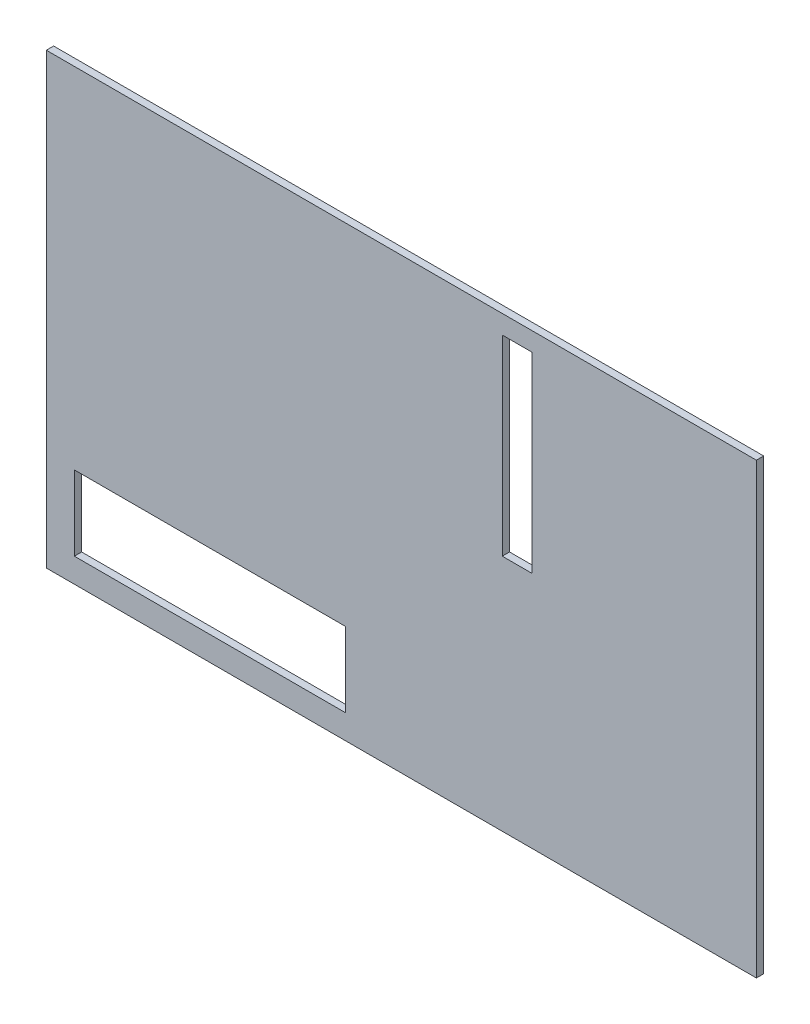
ISO-10303-21;
HEADER;
FILE_DESCRIPTION(('STEP AP214'),'2;1');
FILE_NAME('part.step','',(''),(''),'','','');
FILE_SCHEMA(('AUTOMOTIVE_DESIGN { 1 0 10303 214 1 1 1 1 }'));
ENDSEC;
DATA;
#1=APPLICATION_CONTEXT('core data for automotive mechanical design processes');
#2=APPLICATION_PROTOCOL_DEFINITION('international standard','automotive_design',2000,#1);
#3=PRODUCT_CONTEXT('',#1,'mechanical');
#4=PRODUCT('Part','Part','',(#3));
#5=PRODUCT_RELATED_PRODUCT_CATEGORY('part','',(#4));
#6=PRODUCT_DEFINITION_FORMATION('','',#4);
#7=PRODUCT_DEFINITION_CONTEXT('part definition',#1,'design');
#8=PRODUCT_DEFINITION('design','',#6,#7);
#9=PRODUCT_DEFINITION_SHAPE('','',#8);
#10=(LENGTH_UNIT() NAMED_UNIT(*) SI_UNIT(.MILLI.,.METRE.));
#11=(NAMED_UNIT(*) PLANE_ANGLE_UNIT() SI_UNIT($,.RADIAN.));
#12=(NAMED_UNIT(*) SI_UNIT($,.STERADIAN.) SOLID_ANGLE_UNIT());
#13=UNCERTAINTY_MEASURE_WITH_UNIT(LENGTH_MEASURE(1.E-05),#10,'distance_accuracy_value','');
#14=(GEOMETRIC_REPRESENTATION_CONTEXT(3) GLOBAL_UNCERTAINTY_ASSIGNED_CONTEXT((#13)) GLOBAL_UNIT_ASSIGNED_CONTEXT((#10,
#11,#12)) REPRESENTATION_CONTEXT('',''));
#15=CARTESIAN_POINT('',(0.,0.,0.));
#16=DIRECTION('',(0.,0.,1.));
#17=DIRECTION('',(1.,0.,0.));
#18=AXIS2_PLACEMENT_3D('',#15,#16,#17);
#19=CARTESIAN_POINT('',(48.26,-30.48,0.9906));
#20=DIRECTION('',(-1.,0.,0.));
#21=DIRECTION('',(0.,0.,1.));
#22=AXIS2_PLACEMENT_3D('',#19,#20,#21);
#23=PLANE('',#22);
#24=DIRECTION('',(0.,1.,0.));
#25=VECTOR('',#24,1.);
#26=CARTESIAN_POINT('',(48.26,-30.48,0.));
#27=LINE('',#26,#25);
#28=CARTESIAN_POINT('',(48.26,-30.48,0.));
#29=VERTEX_POINT('',#28);
#30=CARTESIAN_POINT('',(48.26,30.48,0.));
#31=VERTEX_POINT('',#30);
#32=EDGE_CURVE('E186',#29,#31,#27,.T.);
#33=ORIENTED_EDGE('',*,*,#32,.T.);
#34=DIRECTION('',(0.,0.,-1.));
#35=VECTOR('',#34,1.);
#36=CARTESIAN_POINT('',(48.26,30.48,0.9906));
#37=LINE('',#36,#35);
#38=CARTESIAN_POINT('',(48.26,30.48,0.9906));
#39=VERTEX_POINT('',#38);
#40=EDGE_CURVE('E11',#39,#31,#37,.T.);
#41=ORIENTED_EDGE('',*,*,#40,.F.);
#42=DIRECTION('',(0.,1.,0.));
#43=VECTOR('',#42,1.);
#44=CARTESIAN_POINT('',(48.26,-30.48,0.9906));
#45=LINE('',#44,#43);
#46=CARTESIAN_POINT('',(48.26,-30.48,0.9906));
#47=VERTEX_POINT('',#46);
#48=EDGE_CURVE('E187',#47,#39,#45,.T.);
#49=ORIENTED_EDGE('',*,*,#48,.F.);
#50=DIRECTION('',(0.,0.,-1.));
#51=VECTOR('',#50,1.);
#52=CARTESIAN_POINT('',(48.26,-30.48,0.9906));
#53=LINE('',#52,#51);
#54=EDGE_CURVE('E197',#47,#29,#53,.T.);
#55=ORIENTED_EDGE('',*,*,#54,.T.);
#56=EDGE_LOOP('',(#33,#41,#49,#55));
#57=FACE_BOUND('',#56,.T.);
#58=ADVANCED_FACE('F32',(#57),#23,.F.);
#59=CARTESIAN_POINT('',(-48.26,30.48,0.9906));
#60=DIRECTION('',(0.,-1.,0.));
#61=DIRECTION('',(0.,0.,-1.));
#62=AXIS2_PLACEMENT_3D('',#59,#60,#61);
#63=PLANE('',#62);
#64=DIRECTION('',(-1.,0.,0.));
#65=VECTOR('',#64,1.);
#66=CARTESIAN_POINT('',(-48.26,30.48,0.));
#67=LINE('',#66,#65);
#68=CARTESIAN_POINT('',(-48.26,30.48,0.));
#69=VERTEX_POINT('',#68);
#70=EDGE_CURVE('E200',#31,#69,#67,.T.);
#71=ORIENTED_EDGE('',*,*,#70,.T.);
#72=DIRECTION('',(0.,0.,-1.));
#73=VECTOR('',#72,1.);
#74=CARTESIAN_POINT('',(-48.26,30.48,0.9906));
#75=LINE('',#74,#73);
#76=CARTESIAN_POINT('',(-48.26,30.48,0.9906));
#77=VERTEX_POINT('',#76);
#78=EDGE_CURVE('E39',#77,#69,#75,.T.);
#79=ORIENTED_EDGE('',*,*,#78,.F.);
#80=DIRECTION('',(-1.,0.,0.));
#81=VECTOR('',#80,1.);
#82=CARTESIAN_POINT('',(-48.26,30.48,0.9906));
#83=LINE('',#82,#81);
#84=EDGE_CURVE('E190',#39,#77,#83,.T.);
#85=ORIENTED_EDGE('',*,*,#84,.F.);
#86=ORIENTED_EDGE('',*,*,#40,.T.);
#87=EDGE_LOOP('',(#71,#79,#85,#86));
#88=FACE_BOUND('',#87,.T.);
#89=ADVANCED_FACE('F229',(#88),#63,.F.);
#90=CARTESIAN_POINT('',(-48.26,-30.48,0.9906));
#91=DIRECTION('',(1.,0.,0.));
#92=DIRECTION('',(0.,0.,-1.));
#93=AXIS2_PLACEMENT_3D('',#90,#91,#92);
#94=PLANE('',#93);
#95=DIRECTION('',(0.,-1.,0.));
#96=VECTOR('',#95,1.);
#97=CARTESIAN_POINT('',(-48.26,-30.48,0.));
#98=LINE('',#97,#96);
#99=CARTESIAN_POINT('',(-48.26,-30.48,0.));
#100=VERTEX_POINT('',#99);
#101=EDGE_CURVE('E202',#69,#100,#98,.T.);
#102=ORIENTED_EDGE('',*,*,#101,.T.);
#103=DIRECTION('',(0.,0.,-1.));
#104=VECTOR('',#103,1.);
#105=CARTESIAN_POINT('',(-48.26,-30.48,0.9906));
#106=LINE('',#105,#104);
#107=CARTESIAN_POINT('',(-48.26,-30.48,0.9906));
#108=VERTEX_POINT('',#107);
#109=EDGE_CURVE('E207',#108,#100,#106,.T.);
#110=ORIENTED_EDGE('',*,*,#109,.F.);
#111=DIRECTION('',(0.,-1.,0.));
#112=VECTOR('',#111,1.);
#113=CARTESIAN_POINT('',(-48.26,-30.48,0.9906));
#114=LINE('',#113,#112);
#115=EDGE_CURVE('E193',#77,#108,#114,.T.);
#116=ORIENTED_EDGE('',*,*,#115,.F.);
#117=ORIENTED_EDGE('',*,*,#78,.T.);
#118=EDGE_LOOP('',(#102,#110,#116,#117));
#119=FACE_BOUND('',#118,.T.);
#120=ADVANCED_FACE('F214',(#119),#94,.F.);
#121=CARTESIAN_POINT('',(-48.26,-30.48,0.9906));
#122=DIRECTION('',(0.,1.,0.));
#123=DIRECTION('',(0.,0.,1.));
#124=AXIS2_PLACEMENT_3D('',#121,#122,#123);
#125=PLANE('',#124);
#126=DIRECTION('',(1.,0.,0.));
#127=VECTOR('',#126,1.);
#128=CARTESIAN_POINT('',(-48.26,-30.48,0.));
#129=LINE('',#128,#127);
#130=EDGE_CURVE('E191',#100,#29,#129,.T.);
#131=ORIENTED_EDGE('',*,*,#130,.T.);
#132=ORIENTED_EDGE('',*,*,#54,.F.);
#133=DIRECTION('',(1.,0.,0.));
#134=VECTOR('',#133,1.);
#135=CARTESIAN_POINT('',(-48.26,-30.48,0.9906));
#136=LINE('',#135,#134);
#137=EDGE_CURVE('E195',#108,#47,#136,.T.);
#138=ORIENTED_EDGE('',*,*,#137,.F.);
#139=ORIENTED_EDGE('',*,*,#109,.T.);
#140=EDGE_LOOP('',(#131,#132,#138,#139));
#141=FACE_BOUND('',#140,.T.);
#142=ADVANCED_FACE('F222',(#141),#125,.F.);
#143=CARTESIAN_POINT('',(0.,0.,0.9906));
#144=DIRECTION('',(0.,0.,-1.));
#145=DIRECTION('',(-1.,0.,0.));
#146=AXIS2_PLACEMENT_3D('',#143,#144,#145);
#147=PLANE('',#146);
#148=DIRECTION('',(1.,0.,0.));
#149=VECTOR('',#148,1.);
#150=CARTESIAN_POINT('',(13.716,1.90499999999998,0.9906));
#151=LINE('',#150,#149);
#152=CARTESIAN_POINT('',(13.716,1.90499999999998,0.9906));
#153=VERTEX_POINT('',#152);
#154=CARTESIAN_POINT('',(17.78,1.90499999999998,0.9906));
#155=VERTEX_POINT('',#154);
#156=EDGE_CURVE('E139',#153,#155,#151,.T.);
#157=ORIENTED_EDGE('',*,*,#156,.F.);
#158=DIRECTION('',(0.,-1.,0.));
#159=VECTOR('',#158,1.);
#160=CARTESIAN_POINT('',(13.716,27.94,0.9906));
#161=LINE('',#160,#159);
#162=CARTESIAN_POINT('',(13.716,27.94,0.9906));
#163=VERTEX_POINT('',#162);
#164=EDGE_CURVE('E46',#163,#153,#161,.T.);
#165=ORIENTED_EDGE('',*,*,#164,.F.);
#166=DIRECTION('',(-1.,0.,0.));
#167=VECTOR('',#166,1.);
#168=CARTESIAN_POINT('',(13.716,27.94,0.9906));
#169=LINE('',#168,#167);
#170=CARTESIAN_POINT('',(17.78,27.94,0.9906));
#171=VERTEX_POINT('',#170);
#172=EDGE_CURVE('E132',#171,#163,#169,.T.);
#173=ORIENTED_EDGE('',*,*,#172,.F.);
#174=DIRECTION('',(0.,1.,0.));
#175=VECTOR('',#174,1.);
#176=CARTESIAN_POINT('',(17.78,27.94,0.9906));
#177=LINE('',#176,#175);
#178=EDGE_CURVE('E146',#155,#171,#177,.T.);
#179=ORIENTED_EDGE('',*,*,#178,.F.);
#180=EDGE_LOOP('',(#157,#165,#173,#179));
#181=FACE_BOUND('',#180,.T.);
#182=DIRECTION('',(1.,0.,0.));
#183=VECTOR('',#182,1.);
#184=CARTESIAN_POINT('',(-44.45,-27.178,0.9906));
#185=LINE('',#184,#183);
#186=CARTESIAN_POINT('',(-44.45,-27.178,0.9906));
#187=VERTEX_POINT('',#186);
#188=CARTESIAN_POINT('',(-7.62000000000002,-27.178,0.9906));
#189=VERTEX_POINT('',#188);
#190=EDGE_CURVE('E165',#187,#189,#185,.T.);
#191=ORIENTED_EDGE('',*,*,#190,.F.);
#192=DIRECTION('',(0.,-1.,0.));
#193=VECTOR('',#192,1.);
#194=CARTESIAN_POINT('',(-44.45,-17.018,0.9906));
#195=LINE('',#194,#193);
#196=CARTESIAN_POINT('',(-44.45,-17.018,0.9906));
#197=VERTEX_POINT('',#196);
#198=EDGE_CURVE('E163',#197,#187,#195,.T.);
#199=ORIENTED_EDGE('',*,*,#198,.F.);
#200=DIRECTION('',(-1.,0.,0.));
#201=VECTOR('',#200,1.);
#202=CARTESIAN_POINT('',(-44.45,-17.018,0.9906));
#203=LINE('',#202,#201);
#204=CARTESIAN_POINT('',(-7.62000000000002,-17.018,0.9906));
#205=VERTEX_POINT('',#204);
#206=EDGE_CURVE('E171',#205,#197,#203,.T.);
#207=ORIENTED_EDGE('',*,*,#206,.F.);
#208=DIRECTION('',(0.,1.,0.));
#209=VECTOR('',#208,1.);
#210=CARTESIAN_POINT('',(-7.62000000000002,-17.018,0.9906));
#211=LINE('',#210,#209);
#212=EDGE_CURVE('E168',#189,#205,#211,.T.);
#213=ORIENTED_EDGE('',*,*,#212,.F.);
#214=EDGE_LOOP('',(#191,#199,#207,#213));
#215=FACE_BOUND('',#214,.T.);
#216=ORIENTED_EDGE('',*,*,#48,.T.);
#217=ORIENTED_EDGE('',*,*,#84,.T.);
#218=ORIENTED_EDGE('',*,*,#115,.T.);
#219=ORIENTED_EDGE('',*,*,#137,.T.);
#220=EDGE_LOOP('',(#216,#217,#218,#219));
#221=FACE_BOUND('',#220,.T.);
#222=ADVANCED_FACE('F228',(#181,#215,#221),#147,.F.);
#223=CARTESIAN_POINT('',(0.,0.,0.));
#224=DIRECTION('',(0.,0.,-1.));
#225=DIRECTION('',(-1.,0.,0.));
#226=AXIS2_PLACEMENT_3D('',#223,#224,#225);
#227=PLANE('',#226);
#228=DIRECTION('',(0.,-1.,0.));
#229=VECTOR('',#228,1.);
#230=CARTESIAN_POINT('',(13.716,27.94,0.));
#231=LINE('',#230,#229);
#232=CARTESIAN_POINT('',(13.716,27.94,0.));
#233=VERTEX_POINT('',#232);
#234=CARTESIAN_POINT('',(13.716,1.90499999999998,0.));
#235=VERTEX_POINT('',#234);
#236=EDGE_CURVE('E130',#233,#235,#231,.T.);
#237=ORIENTED_EDGE('',*,*,#236,.T.);
#238=DIRECTION('',(1.,0.,0.));
#239=VECTOR('',#238,1.);
#240=CARTESIAN_POINT('',(13.716,1.90499999999998,0.));
#241=LINE('',#240,#239);
#242=CARTESIAN_POINT('',(17.78,1.90499999999998,0.));
#243=VERTEX_POINT('',#242);
#244=EDGE_CURVE('E119',#235,#243,#241,.T.);
#245=ORIENTED_EDGE('',*,*,#244,.T.);
#246=DIRECTION('',(0.,1.,0.));
#247=VECTOR('',#246,1.);
#248=CARTESIAN_POINT('',(17.78,27.94,0.));
#249=LINE('',#248,#247);
#250=CARTESIAN_POINT('',(17.78,27.94,0.));
#251=VERTEX_POINT('',#250);
#252=EDGE_CURVE('E141',#243,#251,#249,.T.);
#253=ORIENTED_EDGE('',*,*,#252,.T.);
#254=DIRECTION('',(-1.,0.,0.));
#255=VECTOR('',#254,1.);
#256=CARTESIAN_POINT('',(13.716,27.94,0.));
#257=LINE('',#256,#255);
#258=EDGE_CURVE('E137',#251,#233,#257,.T.);
#259=ORIENTED_EDGE('',*,*,#258,.T.);
#260=EDGE_LOOP('',(#237,#245,#253,#259));
#261=FACE_BOUND('',#260,.T.);
#262=DIRECTION('',(0.,-1.,0.));
#263=VECTOR('',#262,1.);
#264=CARTESIAN_POINT('',(-44.45,-17.018,0.));
#265=LINE('',#264,#263);
#266=CARTESIAN_POINT('',(-44.45,-17.018,0.));
#267=VERTEX_POINT('',#266);
#268=CARTESIAN_POINT('',(-44.45,-27.178,0.));
#269=VERTEX_POINT('',#268);
#270=EDGE_CURVE('E160',#267,#269,#265,.T.);
#271=ORIENTED_EDGE('',*,*,#270,.T.);
#272=DIRECTION('',(1.,0.,0.));
#273=VECTOR('',#272,1.);
#274=CARTESIAN_POINT('',(-44.45,-27.178,0.));
#275=LINE('',#274,#273);
#276=CARTESIAN_POINT('',(-7.62000000000002,-27.178,0.));
#277=VERTEX_POINT('',#276);
#278=EDGE_CURVE('E177',#269,#277,#275,.T.);
#279=ORIENTED_EDGE('',*,*,#278,.T.);
#280=DIRECTION('',(0.,1.,0.));
#281=VECTOR('',#280,1.);
#282=CARTESIAN_POINT('',(-7.62000000000002,-17.018,0.));
#283=LINE('',#282,#281);
#284=CARTESIAN_POINT('',(-7.62000000000002,-17.018,0.));
#285=VERTEX_POINT('',#284);
#286=EDGE_CURVE('E126',#277,#285,#283,.T.);
#287=ORIENTED_EDGE('',*,*,#286,.T.);
#288=DIRECTION('',(-1.,0.,0.));
#289=VECTOR('',#288,1.);
#290=CARTESIAN_POINT('',(-44.45,-17.018,0.));
#291=LINE('',#290,#289);
#292=EDGE_CURVE('E157',#285,#267,#291,.T.);
#293=ORIENTED_EDGE('',*,*,#292,.T.);
#294=EDGE_LOOP('',(#271,#279,#287,#293));
#295=FACE_BOUND('',#294,.T.);
#296=ORIENTED_EDGE('',*,*,#32,.F.);
#297=ORIENTED_EDGE('',*,*,#130,.F.);
#298=ORIENTED_EDGE('',*,*,#101,.F.);
#299=ORIENTED_EDGE('',*,*,#70,.F.);
#300=EDGE_LOOP('',(#296,#297,#298,#299));
#301=FACE_BOUND('',#300,.T.);
#302=ADVANCED_FACE('F135',(#261,#295,#301),#227,.T.);
#303=CARTESIAN_POINT('',(-44.45,-17.018,-0.000999999999999916));
#304=DIRECTION('',(-1.,0.,0.));
#305=DIRECTION('',(0.,0.,1.));
#306=AXIS2_PLACEMENT_3D('',#303,#304,#305);
#307=PLANE('',#306);
#308=DIRECTION('',(0.,0.,1.));
#309=VECTOR('',#308,1.);
#310=CARTESIAN_POINT('',(-44.45,-17.018,-0.000999999999999916));
#311=LINE('',#310,#309);
#312=EDGE_CURVE('E175',#267,#197,#311,.T.);
#313=ORIENTED_EDGE('',*,*,#312,.T.);
#314=ORIENTED_EDGE('',*,*,#198,.T.);
#315=DIRECTION('',(0.,0.,1.));
#316=VECTOR('',#315,1.);
#317=CARTESIAN_POINT('',(-44.45,-27.178,-0.000999999999999916));
#318=LINE('',#317,#316);
#319=EDGE_CURVE('E174',#269,#187,#318,.T.);
#320=ORIENTED_EDGE('',*,*,#319,.F.);
#321=ORIENTED_EDGE('',*,*,#270,.F.);
#322=EDGE_LOOP('',(#313,#314,#320,#321));
#323=FACE_BOUND('',#322,.T.);
#324=ADVANCED_FACE('F241',(#323),#307,.F.);
#325=CARTESIAN_POINT('',(-44.45,-17.018,-0.000999999999999916));
#326=DIRECTION('',(0.,1.,0.));
#327=DIRECTION('',(0.,0.,1.));
#328=AXIS2_PLACEMENT_3D('',#325,#326,#327);
#329=PLANE('',#328);
#330=DIRECTION('',(0.,0.,1.));
#331=VECTOR('',#330,1.);
#332=CARTESIAN_POINT('',(-7.62000000000002,-17.018,-0.000999999999999916));
#333=LINE('',#332,#331);
#334=EDGE_CURVE('E178',#285,#205,#333,.T.);
#335=ORIENTED_EDGE('',*,*,#334,.T.);
#336=ORIENTED_EDGE('',*,*,#206,.T.);
#337=ORIENTED_EDGE('',*,*,#312,.F.);
#338=ORIENTED_EDGE('',*,*,#292,.F.);
#339=EDGE_LOOP('',(#335,#336,#337,#338));
#340=FACE_BOUND('',#339,.T.);
#341=ADVANCED_FACE('F247',(#340),#329,.F.);
#342=CARTESIAN_POINT('',(-7.62000000000002,-17.018,-0.000999999999999916));
#343=DIRECTION('',(1.,0.,0.));
#344=DIRECTION('',(0.,1.,0.));
#345=AXIS2_PLACEMENT_3D('',#342,#343,#344);
#346=PLANE('',#345);
#347=DIRECTION('',(0.,0.,1.));
#348=VECTOR('',#347,1.);
#349=CARTESIAN_POINT('',(-7.62000000000002,-27.178,-0.000999999999999916));
#350=LINE('',#349,#348);
#351=EDGE_CURVE('E180',#277,#189,#350,.T.);
#352=ORIENTED_EDGE('',*,*,#351,.T.);
#353=ORIENTED_EDGE('',*,*,#212,.T.);
#354=ORIENTED_EDGE('',*,*,#334,.F.);
#355=ORIENTED_EDGE('',*,*,#286,.F.);
#356=EDGE_LOOP('',(#352,#353,#354,#355));
#357=FACE_BOUND('',#356,.T.);
#358=ADVANCED_FACE('F252',(#357),#346,.F.);
#359=CARTESIAN_POINT('',(-44.45,-27.178,-0.000999999999999916));
#360=DIRECTION('',(0.,-1.,0.));
#361=DIRECTION('',(0.,0.,-1.));
#362=AXIS2_PLACEMENT_3D('',#359,#360,#361);
#363=PLANE('',#362);
#364=ORIENTED_EDGE('',*,*,#319,.T.);
#365=ORIENTED_EDGE('',*,*,#190,.T.);
#366=ORIENTED_EDGE('',*,*,#351,.F.);
#367=ORIENTED_EDGE('',*,*,#278,.F.);
#368=EDGE_LOOP('',(#364,#365,#366,#367));
#369=FACE_BOUND('',#368,.T.);
#370=ADVANCED_FACE('F249',(#369),#363,.F.);
#371=CARTESIAN_POINT('',(13.716,27.94,-0.000999999999999916));
#372=DIRECTION('',(-1.,0.,0.));
#373=DIRECTION('',(0.,-1.,0.));
#374=AXIS2_PLACEMENT_3D('',#371,#372,#373);
#375=PLANE('',#374);
#376=DIRECTION('',(0.,0.,1.));
#377=VECTOR('',#376,1.);
#378=CARTESIAN_POINT('',(13.716,27.94,-0.000999999999999916));
#379=LINE('',#378,#377);
#380=EDGE_CURVE('E127',#233,#163,#379,.T.);
#381=ORIENTED_EDGE('',*,*,#380,.T.);
#382=ORIENTED_EDGE('',*,*,#164,.T.);
#383=DIRECTION('',(0.,0.,1.));
#384=VECTOR('',#383,1.);
#385=CARTESIAN_POINT('',(13.716,1.90499999999998,-0.000999999999999916));
#386=LINE('',#385,#384);
#387=EDGE_CURVE('E121',#235,#153,#386,.T.);
#388=ORIENTED_EDGE('',*,*,#387,.F.);
#389=ORIENTED_EDGE('',*,*,#236,.F.);
#390=EDGE_LOOP('',(#381,#382,#388,#389));
#391=FACE_BOUND('',#390,.T.);
#392=ADVANCED_FACE('F129',(#391),#375,.F.);
#393=CARTESIAN_POINT('',(13.716,27.94,-0.000999999999999916));
#394=DIRECTION('',(0.,1.,0.));
#395=DIRECTION('',(0.,0.,1.));
#396=AXIS2_PLACEMENT_3D('',#393,#394,#395);
#397=PLANE('',#396);
#398=DIRECTION('',(0.,0.,1.));
#399=VECTOR('',#398,1.);
#400=CARTESIAN_POINT('',(17.78,27.94,-0.000999999999999916));
#401=LINE('',#400,#399);
#402=EDGE_CURVE('E152',#251,#171,#401,.T.);
#403=ORIENTED_EDGE('',*,*,#402,.T.);
#404=ORIENTED_EDGE('',*,*,#172,.T.);
#405=ORIENTED_EDGE('',*,*,#380,.F.);
#406=ORIENTED_EDGE('',*,*,#258,.F.);
#407=EDGE_LOOP('',(#403,#404,#405,#406));
#408=FACE_BOUND('',#407,.T.);
#409=ADVANCED_FACE('F262',(#408),#397,.F.);
#410=CARTESIAN_POINT('',(17.78,27.94,-0.000999999999999916));
#411=DIRECTION('',(1.,0.,0.));
#412=DIRECTION('',(0.,1.,0.));
#413=AXIS2_PLACEMENT_3D('',#410,#411,#412);
#414=PLANE('',#413);
#415=DIRECTION('',(0.,0.,1.));
#416=VECTOR('',#415,1.);
#417=CARTESIAN_POINT('',(17.78,1.90499999999998,-0.000999999999999916));
#418=LINE('',#417,#416);
#419=EDGE_CURVE('E54',#243,#155,#418,.T.);
#420=ORIENTED_EDGE('',*,*,#419,.T.);
#421=ORIENTED_EDGE('',*,*,#178,.T.);
#422=ORIENTED_EDGE('',*,*,#402,.F.);
#423=ORIENTED_EDGE('',*,*,#252,.F.);
#424=EDGE_LOOP('',(#420,#421,#422,#423));
#425=FACE_BOUND('',#424,.T.);
#426=ADVANCED_FACE('F265',(#425),#414,.F.);
#427=CARTESIAN_POINT('',(13.716,1.90499999999998,-0.000999999999999916));
#428=DIRECTION('',(0.,-1.,0.));
#429=DIRECTION('',(0.,0.,-1.));
#430=AXIS2_PLACEMENT_3D('',#427,#428,#429);
#431=PLANE('',#430);
#432=ORIENTED_EDGE('',*,*,#387,.T.);
#433=ORIENTED_EDGE('',*,*,#156,.T.);
#434=ORIENTED_EDGE('',*,*,#419,.F.);
#435=ORIENTED_EDGE('',*,*,#244,.F.);
#436=EDGE_LOOP('',(#432,#433,#434,#435));
#437=FACE_BOUND('',#436,.T.);
#438=ADVANCED_FACE('F120',(#437),#431,.F.);
#439=CLOSED_SHELL('',(#58,#89,#120,#142,#222,#302,#324,#341,#358,#370,#392,#409,#426,#438));
#440=MANIFOLD_SOLID_BREP('B2',#439);
#441=ADVANCED_BREP_SHAPE_REPRESENTATION('',(#18,#440),#14);
#442=SHAPE_DEFINITION_REPRESENTATION(#9,#441);
ENDSEC;
END-ISO-10303-21;
